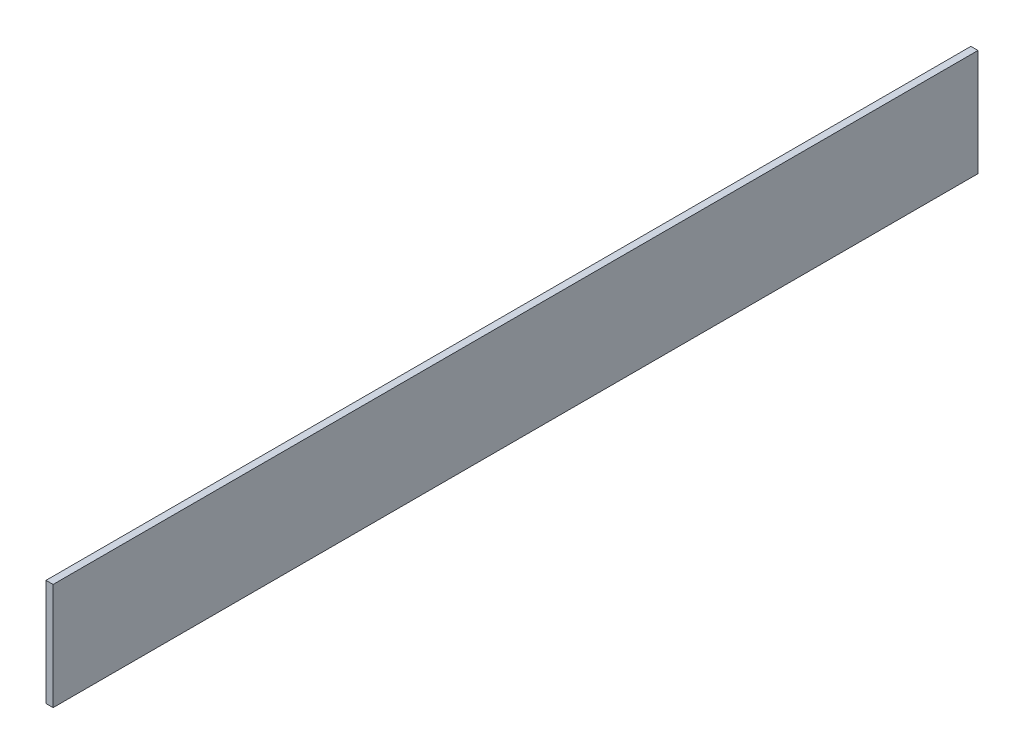
ISO-10303-21;
HEADER;
FILE_DESCRIPTION(('STEP AP214'),'2;1');
FILE_NAME('part.step','',(''),(''),'','','');
FILE_SCHEMA(('AUTOMOTIVE_DESIGN { 1 0 10303 214 1 1 1 1 }'));
ENDSEC;
DATA;
#1=APPLICATION_CONTEXT('core data for automotive mechanical design processes');
#2=APPLICATION_PROTOCOL_DEFINITION('international standard','automotive_design',2000,#1);
#3=PRODUCT_CONTEXT('',#1,'mechanical');
#4=PRODUCT('Part','Part','',(#3));
#5=PRODUCT_RELATED_PRODUCT_CATEGORY('part','',(#4));
#6=PRODUCT_DEFINITION_FORMATION('','',#4);
#7=PRODUCT_DEFINITION_CONTEXT('part definition',#1,'design');
#8=PRODUCT_DEFINITION('design','',#6,#7);
#9=PRODUCT_DEFINITION_SHAPE('','',#8);
#10=(LENGTH_UNIT() NAMED_UNIT(*) SI_UNIT(.MILLI.,.METRE.));
#11=(NAMED_UNIT(*) PLANE_ANGLE_UNIT() SI_UNIT($,.RADIAN.));
#12=(NAMED_UNIT(*) SI_UNIT($,.STERADIAN.) SOLID_ANGLE_UNIT());
#13=UNCERTAINTY_MEASURE_WITH_UNIT(LENGTH_MEASURE(1.E-05),#10,'distance_accuracy_value','');
#14=(GEOMETRIC_REPRESENTATION_CONTEXT(3) GLOBAL_UNCERTAINTY_ASSIGNED_CONTEXT((#13)) GLOBAL_UNIT_ASSIGNED_CONTEXT((#10,
#11,#12)) REPRESENTATION_CONTEXT('',''));
#15=CARTESIAN_POINT('',(0.,0.,0.));
#16=DIRECTION('',(0.,0.,1.));
#17=DIRECTION('',(1.,0.,0.));
#18=AXIS2_PLACEMENT_3D('',#15,#16,#17);
#19=CARTESIAN_POINT('',(149.,35.,-75.));
#20=DIRECTION('',(1.,0.,0.));
#21=DIRECTION('',(0.,0.,-1.));
#22=AXIS2_PLACEMENT_3D('',#19,#20,#21);
#23=PLANE('',#22);
#24=DIRECTION('',(0.,0.,-1.));
#25=VECTOR('',#24,1.);
#26=CARTESIAN_POINT('',(149.,20.,-75.));
#27=LINE('',#26,#25);
#28=CARTESIAN_POINT('',(149.,20.,-75.));
#29=VERTEX_POINT('',#28);
#30=CARTESIAN_POINT('',(149.,20.,55.));
#31=VERTEX_POINT('',#30);
#32=EDGE_CURVE('E94',#29,#31,#27,.F.);
#33=ORIENTED_EDGE('',*,*,#32,.T.);
#34=DIRECTION('',(0.,-1.,0.));
#35=VECTOR('',#34,1.);
#36=CARTESIAN_POINT('',(149.,35.,55.));
#37=LINE('',#36,#35);
#38=CARTESIAN_POINT('',(149.,35.,55.));
#39=VERTEX_POINT('',#38);
#40=EDGE_CURVE('E11',#39,#31,#37,.T.);
#41=ORIENTED_EDGE('',*,*,#40,.F.);
#42=DIRECTION('',(0.,0.,-1.));
#43=VECTOR('',#42,1.);
#44=CARTESIAN_POINT('',(149.,35.,-75.));
#45=LINE('',#44,#43);
#46=CARTESIAN_POINT('',(149.,35.,-75.));
#47=VERTEX_POINT('',#46);
#48=EDGE_CURVE('E71',#47,#39,#45,.F.);
#49=ORIENTED_EDGE('',*,*,#48,.F.);
#50=DIRECTION('',(0.,-1.,0.));
#51=VECTOR('',#50,1.);
#52=CARTESIAN_POINT('',(149.,35.,-75.));
#53=LINE('',#52,#51);
#54=EDGE_CURVE('E47',#47,#29,#53,.T.);
#55=ORIENTED_EDGE('',*,*,#54,.T.);
#56=EDGE_LOOP('',(#33,#41,#49,#55));
#57=FACE_BOUND('',#56,.T.);
#58=ADVANCED_FACE('F31',(#57),#23,.F.);
#59=CARTESIAN_POINT('',(150.,35.,55.));
#60=DIRECTION('',(0.,0.,1.));
#61=DIRECTION('',(1.,0.,0.));
#62=AXIS2_PLACEMENT_3D('',#59,#60,#61);
#63=PLANE('',#62);
#64=DIRECTION('',(-1.,0.,0.));
#65=VECTOR('',#64,1.);
#66=CARTESIAN_POINT('',(150.,20.,55.));
#67=LINE('',#66,#65);
#68=CARTESIAN_POINT('',(150.,20.,55.));
#69=VERTEX_POINT('',#68);
#70=EDGE_CURVE('E80',#69,#31,#67,.T.);
#71=ORIENTED_EDGE('',*,*,#70,.F.);
#72=DIRECTION('',(0.,-1.,0.));
#73=VECTOR('',#72,1.);
#74=CARTESIAN_POINT('',(150.,35.,55.));
#75=LINE('',#74,#73);
#76=CARTESIAN_POINT('',(150.,35.,55.));
#77=VERTEX_POINT('',#76);
#78=EDGE_CURVE('E39',#77,#69,#75,.T.);
#79=ORIENTED_EDGE('',*,*,#78,.F.);
#80=DIRECTION('',(-1.,0.,0.));
#81=VECTOR('',#80,1.);
#82=CARTESIAN_POINT('',(150.,35.,55.));
#83=LINE('',#82,#81);
#84=EDGE_CURVE('E78',#77,#39,#83,.T.);
#85=ORIENTED_EDGE('',*,*,#84,.T.);
#86=ORIENTED_EDGE('',*,*,#40,.T.);
#87=EDGE_LOOP('',(#71,#79,#85,#86));
#88=FACE_BOUND('',#87,.T.);
#89=ADVANCED_FACE('F77',(#88),#63,.T.);
#90=CARTESIAN_POINT('',(150.,35.,-75.));
#91=DIRECTION('',(1.,0.,0.));
#92=DIRECTION('',(0.,0.,-1.));
#93=AXIS2_PLACEMENT_3D('',#90,#91,#92);
#94=PLANE('',#93);
#95=DIRECTION('',(0.,0.,1.));
#96=VECTOR('',#95,1.);
#97=CARTESIAN_POINT('',(150.,20.,-75.));
#98=LINE('',#97,#96);
#99=CARTESIAN_POINT('',(150.,20.,-75.));
#100=VERTEX_POINT('',#99);
#101=EDGE_CURVE('E97',#100,#69,#98,.T.);
#102=ORIENTED_EDGE('',*,*,#101,.F.);
#103=DIRECTION('',(0.,-1.,0.));
#104=VECTOR('',#103,1.);
#105=CARTESIAN_POINT('',(150.,35.,-75.));
#106=LINE('',#105,#104);
#107=CARTESIAN_POINT('',(150.,35.,-75.));
#108=VERTEX_POINT('',#107);
#109=EDGE_CURVE('E60',#108,#100,#106,.T.);
#110=ORIENTED_EDGE('',*,*,#109,.F.);
#111=DIRECTION('',(0.,0.,1.));
#112=VECTOR('',#111,1.);
#113=CARTESIAN_POINT('',(150.,35.,-75.));
#114=LINE('',#113,#112);
#115=EDGE_CURVE('E86',#108,#77,#114,.T.);
#116=ORIENTED_EDGE('',*,*,#115,.T.);
#117=ORIENTED_EDGE('',*,*,#78,.T.);
#118=EDGE_LOOP('',(#102,#110,#116,#117));
#119=FACE_BOUND('',#118,.T.);
#120=ADVANCED_FACE('F88',(#119),#94,.T.);
#121=CARTESIAN_POINT('',(149.,35.,-75.));
#122=DIRECTION('',(0.,0.,-1.));
#123=DIRECTION('',(-1.,0.,0.));
#124=AXIS2_PLACEMENT_3D('',#121,#122,#123);
#125=PLANE('',#124);
#126=DIRECTION('',(1.,0.,0.));
#127=VECTOR('',#126,1.);
#128=CARTESIAN_POINT('',(149.,20.,-75.));
#129=LINE('',#128,#127);
#130=EDGE_CURVE('E99',#29,#100,#129,.T.);
#131=ORIENTED_EDGE('',*,*,#130,.F.);
#132=ORIENTED_EDGE('',*,*,#54,.F.);
#133=DIRECTION('',(1.,0.,0.));
#134=VECTOR('',#133,1.);
#135=CARTESIAN_POINT('',(149.,35.,-75.));
#136=LINE('',#135,#134);
#137=EDGE_CURVE('E89',#47,#108,#136,.T.);
#138=ORIENTED_EDGE('',*,*,#137,.T.);
#139=ORIENTED_EDGE('',*,*,#109,.T.);
#140=EDGE_LOOP('',(#131,#132,#138,#139));
#141=FACE_BOUND('',#140,.T.);
#142=ADVANCED_FACE('F105',(#141),#125,.T.);
#143=CARTESIAN_POINT('',(149.,35.,55.));
#144=DIRECTION('',(0.,1.,0.));
#145=DIRECTION('',(0.,0.,1.));
#146=AXIS2_PLACEMENT_3D('',#143,#144,#145);
#147=PLANE('',#146);
#148=ORIENTED_EDGE('',*,*,#48,.T.);
#149=ORIENTED_EDGE('',*,*,#84,.F.);
#150=ORIENTED_EDGE('',*,*,#115,.F.);
#151=ORIENTED_EDGE('',*,*,#137,.F.);
#152=EDGE_LOOP('',(#148,#149,#150,#151));
#153=FACE_BOUND('',#152,.T.);
#154=ADVANCED_FACE('F85',(#153),#147,.T.);
#155=CARTESIAN_POINT('',(149.,20.,55.));
#156=DIRECTION('',(0.,1.,0.));
#157=DIRECTION('',(0.,0.,1.));
#158=AXIS2_PLACEMENT_3D('',#155,#156,#157);
#159=PLANE('',#158);
#160=ORIENTED_EDGE('',*,*,#32,.F.);
#161=ORIENTED_EDGE('',*,*,#130,.T.);
#162=ORIENTED_EDGE('',*,*,#101,.T.);
#163=ORIENTED_EDGE('',*,*,#70,.T.);
#164=EDGE_LOOP('',(#160,#161,#162,#163));
#165=FACE_BOUND('',#164,.T.);
#166=ADVANCED_FACE('F104',(#165),#159,.F.);
#167=CLOSED_SHELL('',(#58,#89,#120,#142,#154,#166));
#168=MANIFOLD_SOLID_BREP('B2',#167);
#169=ADVANCED_BREP_SHAPE_REPRESENTATION('',(#18,#168),#14);
#170=SHAPE_DEFINITION_REPRESENTATION(#9,#169);
ENDSEC;
END-ISO-10303-21;
